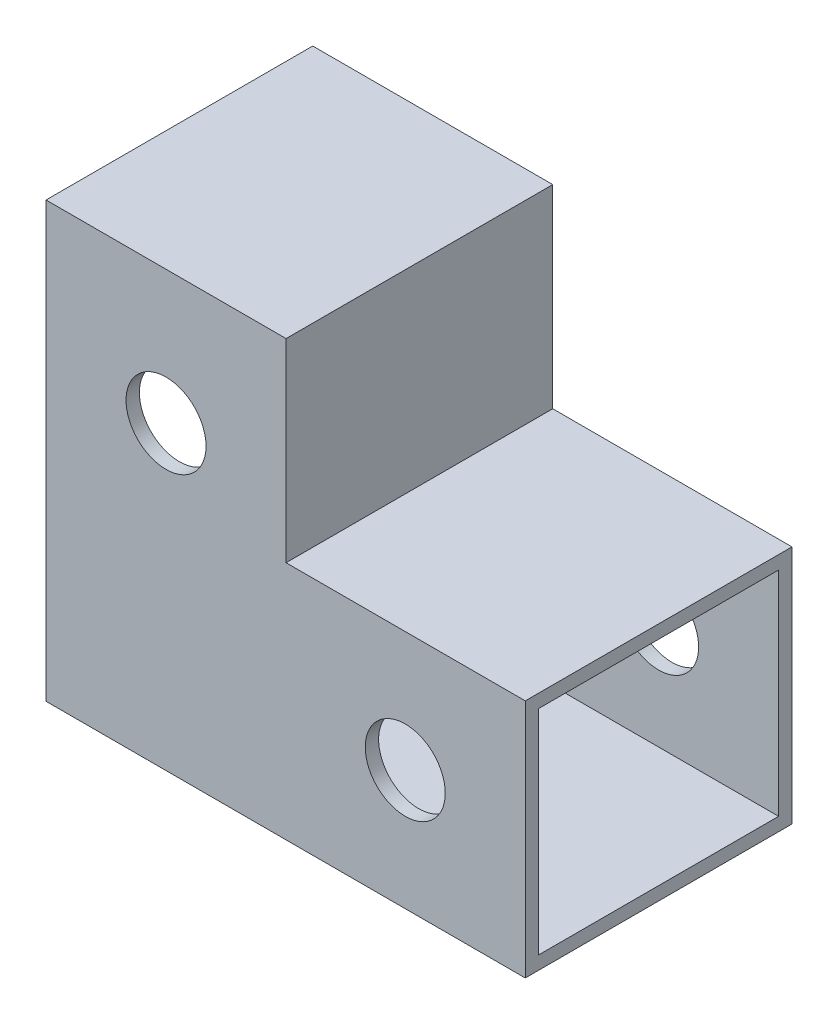
ISO-10303-21;
HEADER;
FILE_DESCRIPTION(('STEP AP214'),'2;1');
FILE_NAME('part.step','',(''),(''),'','','');
FILE_SCHEMA(('AUTOMOTIVE_DESIGN { 1 0 10303 214 1 1 1 1 }'));
ENDSEC;
DATA;
#1=APPLICATION_CONTEXT('core data for automotive mechanical design processes');
#2=APPLICATION_PROTOCOL_DEFINITION('international standard','automotive_design',2000,#1);
#3=PRODUCT_CONTEXT('',#1,'mechanical');
#4=PRODUCT('Part','Part','',(#3));
#5=PRODUCT_RELATED_PRODUCT_CATEGORY('part','',(#4));
#6=PRODUCT_DEFINITION_FORMATION('','',#4);
#7=PRODUCT_DEFINITION_CONTEXT('part definition',#1,'design');
#8=PRODUCT_DEFINITION('design','',#6,#7);
#9=PRODUCT_DEFINITION_SHAPE('','',#8);
#10=(LENGTH_UNIT() NAMED_UNIT(*) SI_UNIT(.MILLI.,.METRE.));
#11=(NAMED_UNIT(*) PLANE_ANGLE_UNIT() SI_UNIT($,.RADIAN.));
#12=(NAMED_UNIT(*) SI_UNIT($,.STERADIAN.) SOLID_ANGLE_UNIT());
#13=UNCERTAINTY_MEASURE_WITH_UNIT(LENGTH_MEASURE(1.E-05),#10,'distance_accuracy_value','');
#14=(GEOMETRIC_REPRESENTATION_CONTEXT(3) GLOBAL_UNCERTAINTY_ASSIGNED_CONTEXT((#13)) GLOBAL_UNIT_ASSIGNED_CONTEXT((#10,
#11,#12)) REPRESENTATION_CONTEXT('',''));
#15=CARTESIAN_POINT('',(0.,0.,0.));
#16=DIRECTION('',(0.,0.,1.));
#17=DIRECTION('',(1.,0.,0.));
#18=AXIS2_PLACEMENT_3D('',#15,#16,#17);
#19=CARTESIAN_POINT('',(-17.94,13.56,20.));
#20=DIRECTION('',(0.,0.,-1.));
#21=DIRECTION('',(-1.,0.,0.));
#22=AXIS2_PLACEMENT_3D('',#19,#20,#21);
#23=CYLINDRICAL_SURFACE('',#22,3.);
#24=CARTESIAN_POINT('',(-17.94,13.56,1.));
#25=DIRECTION('',(0.,0.,-1.));
#26=DIRECTION('',(-1.,0.,0.));
#27=AXIS2_PLACEMENT_3D('',#24,#25,#26);
#28=CIRCLE('',#27,3.);
#29=CARTESIAN_POINT('',(-20.94,13.56,1.));
#30=VERTEX_POINT('',#29);
#31=EDGE_CURVE('E195',#30,#30,#28,.T.);
#32=ORIENTED_EDGE('',*,*,#31,.F.);
#33=EDGE_LOOP('',(#32));
#34=FACE_BOUND('',#33,.T.);
#35=CARTESIAN_POINT('',(-17.94,13.56,0.));
#36=DIRECTION('',(0.,0.,1.));
#37=DIRECTION('',(1.,0.,0.));
#38=AXIS2_PLACEMENT_3D('',#35,#36,#37);
#39=CIRCLE('',#38,3.);
#40=CARTESIAN_POINT('',(-14.94,13.56,0.));
#41=VERTEX_POINT('',#40);
#42=EDGE_CURVE('E267',#41,#41,#39,.T.);
#43=ORIENTED_EDGE('',*,*,#42,.F.);
#44=EDGE_LOOP('',(#43));
#45=FACE_BOUND('',#44,.T.);
#46=ADVANCED_FACE('F63',(#34,#45),#23,.F.);
#47=CARTESIAN_POINT('',(-26.94,8.,0.));
#48=DIRECTION('',(0.,1.,0.));
#49=DIRECTION('',(-1.,0.,0.));
#50=AXIS2_PLACEMENT_3D('',#47,#48,#49);
#51=PLANE('',#50);
#52=DIRECTION('',(0.,0.,1.));
#53=VECTOR('',#52,1.);
#54=CARTESIAN_POINT('',(-9.93999999999999,8.,0.));
#55=LINE('',#54,#53);
#56=CARTESIAN_POINT('',(-9.93999999999999,8.,1.));
#57=VERTEX_POINT('',#56);
#58=CARTESIAN_POINT('',(-9.94,8.,19.));
#59=VERTEX_POINT('',#58);
#60=EDGE_CURVE('E160',#57,#59,#55,.T.);
#61=ORIENTED_EDGE('',*,*,#60,.F.);
#62=DIRECTION('',(1.,0.,0.));
#63=VECTOR('',#62,1.);
#64=CARTESIAN_POINT('',(-26.94,8.,1.));
#65=LINE('',#64,#63);
#66=CARTESIAN_POINT('',(9.,8.,1.));
#67=VERTEX_POINT('',#66);
#68=EDGE_CURVE('E229',#57,#67,#65,.T.);
#69=ORIENTED_EDGE('',*,*,#68,.T.);
#70=DIRECTION('',(0.,0.,1.));
#71=VECTOR('',#70,1.);
#72=CARTESIAN_POINT('',(9.,8.,0.));
#73=LINE('',#72,#71);
#74=CARTESIAN_POINT('',(9.,8.,19.));
#75=VERTEX_POINT('',#74);
#76=EDGE_CURVE('E215',#67,#75,#73,.T.);
#77=ORIENTED_EDGE('',*,*,#76,.T.);
#78=DIRECTION('',(1.,0.,0.));
#79=VECTOR('',#78,1.);
#80=CARTESIAN_POINT('',(-26.94,8.,19.));
#81=LINE('',#80,#79);
#82=EDGE_CURVE('E226',#59,#75,#81,.T.);
#83=ORIENTED_EDGE('',*,*,#82,.F.);
#84=EDGE_LOOP('',(#61,#69,#77,#83));
#85=FACE_BOUND('',#84,.T.);
#86=ADVANCED_FACE('F319',(#85),#51,.F.);
#87=CARTESIAN_POINT('',(0.,0.,20.));
#88=DIRECTION('',(0.,0.,-1.));
#89=DIRECTION('',(-1.,0.,0.));
#90=AXIS2_PLACEMENT_3D('',#87,#88,#89);
#91=CYLINDRICAL_SURFACE('',#90,3.);
#92=CARTESIAN_POINT('',(0.,0.,19.));
#93=DIRECTION('',(0.,0.,1.));
#94=DIRECTION('',(1.,0.,0.));
#95=AXIS2_PLACEMENT_3D('',#92,#93,#94);
#96=CIRCLE('',#95,3.);
#97=CARTESIAN_POINT('',(3.,0.,19.));
#98=VERTEX_POINT('',#97);
#99=EDGE_CURVE('E67',#98,#98,#96,.T.);
#100=ORIENTED_EDGE('',*,*,#99,.F.);
#101=EDGE_LOOP('',(#100));
#102=FACE_BOUND('',#101,.T.);
#103=CARTESIAN_POINT('',(0.,0.,20.));
#104=DIRECTION('',(0.,0.,1.));
#105=DIRECTION('',(1.,0.,0.));
#106=AXIS2_PLACEMENT_3D('',#103,#104,#105);
#107=CIRCLE('',#106,3.);
#108=CARTESIAN_POINT('',(3.,0.,20.));
#109=VERTEX_POINT('',#108);
#110=EDGE_CURVE('E234',#109,#109,#107,.T.);
#111=ORIENTED_EDGE('',*,*,#110,.T.);
#112=EDGE_LOOP('',(#111));
#113=FACE_BOUND('',#112,.T.);
#114=ADVANCED_FACE('F315',(#102,#113),#91,.F.);
#115=CARTESIAN_POINT('',(-8.94,0.,20.));
#116=DIRECTION('',(-1.,0.,0.));
#117=DIRECTION('',(0.,-1.,0.));
#118=AXIS2_PLACEMENT_3D('',#115,#116,#117);
#119=PLANE('',#118);
#120=DIRECTION('',(0.,1.,0.));
#121=VECTOR('',#120,1.);
#122=CARTESIAN_POINT('',(-8.94,0.,0.));
#123=LINE('',#122,#121);
#124=CARTESIAN_POINT('',(-8.94,9.,0.));
#125=VERTEX_POINT('',#124);
#126=CARTESIAN_POINT('',(-8.94,23.56,0.));
#127=VERTEX_POINT('',#126);
#128=EDGE_CURVE('E271',#125,#127,#123,.T.);
#129=ORIENTED_EDGE('',*,*,#128,.T.);
#130=DIRECTION('',(0.,0.,-1.));
#131=VECTOR('',#130,1.);
#132=CARTESIAN_POINT('',(-8.94,23.56,20.));
#133=LINE('',#132,#131);
#134=CARTESIAN_POINT('',(-8.94,23.56,20.));
#135=VERTEX_POINT('',#134);
#136=EDGE_CURVE('E12',#135,#127,#133,.T.);
#137=ORIENTED_EDGE('',*,*,#136,.F.);
#138=DIRECTION('',(0.,1.,0.));
#139=VECTOR('',#138,1.);
#140=CARTESIAN_POINT('',(-8.94,0.,20.));
#141=LINE('',#140,#139);
#142=CARTESIAN_POINT('',(-8.94,9.,20.));
#143=VERTEX_POINT('',#142);
#144=EDGE_CURVE('E243',#143,#135,#141,.T.);
#145=ORIENTED_EDGE('',*,*,#144,.F.);
#146=DIRECTION('',(0.,0.,-1.));
#147=VECTOR('',#146,1.);
#148=CARTESIAN_POINT('',(-8.94,9.,20.));
#149=LINE('',#148,#147);
#150=EDGE_CURVE('E262',#143,#125,#149,.T.);
#151=ORIENTED_EDGE('',*,*,#150,.T.);
#152=EDGE_LOOP('',(#129,#137,#145,#151));
#153=FACE_BOUND('',#152,.T.);
#154=ADVANCED_FACE('F318',(#153),#119,.F.);
#155=CARTESIAN_POINT('',(0.,23.56,20.));
#156=DIRECTION('',(0.,-1.,0.));
#157=DIRECTION('',(1.,0.,0.));
#158=AXIS2_PLACEMENT_3D('',#155,#156,#157);
#159=PLANE('',#158);
#160=DIRECTION('',(-1.,0.,0.));
#161=VECTOR('',#160,1.);
#162=CARTESIAN_POINT('',(0.,23.56,0.));
#163=LINE('',#162,#161);
#164=CARTESIAN_POINT('',(-26.94,23.56,0.));
#165=VERTEX_POINT('',#164);
#166=EDGE_CURVE('E275',#127,#165,#163,.T.);
#167=ORIENTED_EDGE('',*,*,#166,.T.);
#168=DIRECTION('',(0.,0.,-1.));
#169=VECTOR('',#168,1.);
#170=CARTESIAN_POINT('',(-26.94,23.56,20.));
#171=LINE('',#170,#169);
#172=CARTESIAN_POINT('',(-26.94,23.56,20.));
#173=VERTEX_POINT('',#172);
#174=EDGE_CURVE('E73',#173,#165,#171,.T.);
#175=ORIENTED_EDGE('',*,*,#174,.F.);
#176=DIRECTION('',(-1.,0.,0.));
#177=VECTOR('',#176,1.);
#178=CARTESIAN_POINT('',(0.,23.56,20.));
#179=LINE('',#178,#177);
#180=EDGE_CURVE('E247',#135,#173,#179,.T.);
#181=ORIENTED_EDGE('',*,*,#180,.F.);
#182=ORIENTED_EDGE('',*,*,#136,.T.);
#183=EDGE_LOOP('',(#167,#175,#181,#182));
#184=FACE_BOUND('',#183,.T.);
#185=ADVANCED_FACE('F338',(#184),#159,.F.);
#186=CARTESIAN_POINT('',(-26.94,0.,20.));
#187=DIRECTION('',(1.,0.,0.));
#188=DIRECTION('',(0.,1.,0.));
#189=AXIS2_PLACEMENT_3D('',#186,#187,#188);
#190=PLANE('',#189);
#191=DIRECTION('',(0.,1.,0.));
#192=VECTOR('',#191,1.);
#193=CARTESIAN_POINT('',(-26.94,0.,1.));
#194=LINE('',#193,#192);
#195=CARTESIAN_POINT('',(-26.94,-8.,1.));
#196=VERTEX_POINT('',#195);
#197=CARTESIAN_POINT('',(-26.94,22.56,1.));
#198=VERTEX_POINT('',#197);
#199=EDGE_CURVE('E204',#196,#198,#194,.T.);
#200=ORIENTED_EDGE('',*,*,#199,.T.);
#201=DIRECTION('',(0.,0.,-1.));
#202=VECTOR('',#201,1.);
#203=CARTESIAN_POINT('',(-26.94,22.56,0.));
#204=LINE('',#203,#202);
#205=CARTESIAN_POINT('',(-26.94,22.56,19.));
#206=VERTEX_POINT('',#205);
#207=EDGE_CURVE('E164',#206,#198,#204,.T.);
#208=ORIENTED_EDGE('',*,*,#207,.F.);
#209=DIRECTION('',(0.,-1.,0.));
#210=VECTOR('',#209,1.);
#211=CARTESIAN_POINT('',(-26.94,0.,19.));
#212=LINE('',#211,#210);
#213=CARTESIAN_POINT('',(-26.94,-8.,19.));
#214=VERTEX_POINT('',#213);
#215=EDGE_CURVE('E171',#206,#214,#212,.T.);
#216=ORIENTED_EDGE('',*,*,#215,.T.);
#217=DIRECTION('',(0.,0.,-1.));
#218=VECTOR('',#217,1.);
#219=CARTESIAN_POINT('',(-26.94,-8.,0.));
#220=LINE('',#219,#218);
#221=EDGE_CURVE('E200',#214,#196,#220,.T.);
#222=ORIENTED_EDGE('',*,*,#221,.T.);
#223=EDGE_LOOP('',(#200,#208,#216,#222));
#224=FACE_BOUND('',#223,.T.);
#225=DIRECTION('',(0.,-1.,0.));
#226=VECTOR('',#225,1.);
#227=CARTESIAN_POINT('',(-26.94,0.,0.));
#228=LINE('',#227,#226);
#229=CARTESIAN_POINT('',(-26.94,-9.,0.));
#230=VERTEX_POINT('',#229);
#231=EDGE_CURVE('E278',#165,#230,#228,.T.);
#232=ORIENTED_EDGE('',*,*,#231,.T.);
#233=DIRECTION('',(0.,0.,-1.));
#234=VECTOR('',#233,1.);
#235=CARTESIAN_POINT('',(-26.94,-9.,20.));
#236=LINE('',#235,#234);
#237=CARTESIAN_POINT('',(-26.94,-9.,20.));
#238=VERTEX_POINT('',#237);
#239=EDGE_CURVE('E300',#238,#230,#236,.T.);
#240=ORIENTED_EDGE('',*,*,#239,.F.);
#241=DIRECTION('',(0.,-1.,0.));
#242=VECTOR('',#241,1.);
#243=CARTESIAN_POINT('',(-26.94,0.,20.));
#244=LINE('',#243,#242);
#245=EDGE_CURVE('E250',#173,#238,#244,.T.);
#246=ORIENTED_EDGE('',*,*,#245,.F.);
#247=ORIENTED_EDGE('',*,*,#174,.T.);
#248=EDGE_LOOP('',(#232,#240,#246,#247));
#249=FACE_BOUND('',#248,.T.);
#250=ADVANCED_FACE('F343',(#224,#249),#190,.F.);
#251=CARTESIAN_POINT('',(0.,-9.,20.));
#252=DIRECTION('',(0.,1.,0.));
#253=DIRECTION('',(-1.,0.,0.));
#254=AXIS2_PLACEMENT_3D('',#251,#252,#253);
#255=PLANE('',#254);
#256=DIRECTION('',(1.,0.,0.));
#257=VECTOR('',#256,1.);
#258=CARTESIAN_POINT('',(0.,-9.,0.));
#259=LINE('',#258,#257);
#260=CARTESIAN_POINT('',(9.,-9.,0.));
#261=VERTEX_POINT('',#260);
#262=EDGE_CURVE('E281',#230,#261,#259,.T.);
#263=ORIENTED_EDGE('',*,*,#262,.T.);
#264=DIRECTION('',(0.,0.,-1.));
#265=VECTOR('',#264,1.);
#266=CARTESIAN_POINT('',(9.,-9.,20.));
#267=LINE('',#266,#265);
#268=CARTESIAN_POINT('',(9.,-9.,20.));
#269=VERTEX_POINT('',#268);
#270=EDGE_CURVE('E296',#269,#261,#267,.T.);
#271=ORIENTED_EDGE('',*,*,#270,.F.);
#272=DIRECTION('',(1.,0.,0.));
#273=VECTOR('',#272,1.);
#274=CARTESIAN_POINT('',(0.,-9.,20.));
#275=LINE('',#274,#273);
#276=EDGE_CURVE('E253',#238,#269,#275,.T.);
#277=ORIENTED_EDGE('',*,*,#276,.F.);
#278=ORIENTED_EDGE('',*,*,#239,.T.);
#279=EDGE_LOOP('',(#263,#271,#277,#278));
#280=FACE_BOUND('',#279,.T.);
#281=ADVANCED_FACE('F349',(#280),#255,.F.);
#282=CARTESIAN_POINT('',(9.,0.,20.));
#283=DIRECTION('',(-1.,0.,0.));
#284=DIRECTION('',(0.,-1.,0.));
#285=AXIS2_PLACEMENT_3D('',#282,#283,#284);
#286=PLANE('',#285);
#287=DIRECTION('',(0.,1.,0.));
#288=VECTOR('',#287,1.);
#289=CARTESIAN_POINT('',(9.,0.,1.));
#290=LINE('',#289,#288);
#291=CARTESIAN_POINT('',(9.,-8.,1.));
#292=VERTEX_POINT('',#291);
#293=EDGE_CURVE('E212',#292,#67,#290,.T.);
#294=ORIENTED_EDGE('',*,*,#293,.F.);
#295=DIRECTION('',(0.,0.,-1.));
#296=VECTOR('',#295,1.);
#297=CARTESIAN_POINT('',(9.,-8.,0.));
#298=LINE('',#297,#296);
#299=CARTESIAN_POINT('',(9.,-8.,19.));
#300=VERTEX_POINT('',#299);
#301=EDGE_CURVE('E199',#300,#292,#298,.T.);
#302=ORIENTED_EDGE('',*,*,#301,.F.);
#303=DIRECTION('',(0.,-1.,0.));
#304=VECTOR('',#303,1.);
#305=CARTESIAN_POINT('',(9.,0.,19.));
#306=LINE('',#305,#304);
#307=EDGE_CURVE('E205',#75,#300,#306,.T.);
#308=ORIENTED_EDGE('',*,*,#307,.F.);
#309=ORIENTED_EDGE('',*,*,#76,.F.);
#310=EDGE_LOOP('',(#294,#302,#308,#309));
#311=FACE_BOUND('',#310,.T.);
#312=DIRECTION('',(0.,1.,0.));
#313=VECTOR('',#312,1.);
#314=CARTESIAN_POINT('',(9.,0.,0.));
#315=LINE('',#314,#313);
#316=CARTESIAN_POINT('',(9.,9.,0.));
#317=VERTEX_POINT('',#316);
#318=EDGE_CURVE('E284',#261,#317,#315,.T.);
#319=ORIENTED_EDGE('',*,*,#318,.T.);
#320=DIRECTION('',(0.,0.,-1.));
#321=VECTOR('',#320,1.);
#322=CARTESIAN_POINT('',(9.,9.,20.));
#323=LINE('',#322,#321);
#324=CARTESIAN_POINT('',(9.,9.,20.));
#325=VERTEX_POINT('',#324);
#326=EDGE_CURVE('E292',#325,#317,#323,.T.);
#327=ORIENTED_EDGE('',*,*,#326,.F.);
#328=DIRECTION('',(0.,1.,0.));
#329=VECTOR('',#328,1.);
#330=CARTESIAN_POINT('',(9.,0.,20.));
#331=LINE('',#330,#329);
#332=EDGE_CURVE('E256',#269,#325,#331,.T.);
#333=ORIENTED_EDGE('',*,*,#332,.F.);
#334=ORIENTED_EDGE('',*,*,#270,.T.);
#335=EDGE_LOOP('',(#319,#327,#333,#334));
#336=FACE_BOUND('',#335,.T.);
#337=ADVANCED_FACE('F353',(#311,#336),#286,.F.);
#338=CARTESIAN_POINT('',(-17.94,13.56,19.));
#339=DIRECTION('',(0.,0.,1.));
#340=DIRECTION('',(1.,0.,0.));
#341=AXIS2_PLACEMENT_3D('',#338,#339,#340);
#342=CIRCLE('',#341,3.);
#343=CARTESIAN_POINT('',(-14.94,13.56,19.));
#344=VERTEX_POINT('',#343);
#345=EDGE_CURVE('E191',#344,#344,#342,.T.);
#346=ORIENTED_EDGE('',*,*,#345,.F.);
#347=EDGE_LOOP('',(#346));
#348=FACE_BOUND('',#347,.T.);
#349=CARTESIAN_POINT('',(-17.94,13.56,20.));
#350=DIRECTION('',(0.,0.,1.));
#351=DIRECTION('',(1.,0.,0.));
#352=AXIS2_PLACEMENT_3D('',#349,#350,#351);
#353=CIRCLE('',#352,3.);
#354=CARTESIAN_POINT('',(-14.94,13.56,20.));
#355=VERTEX_POINT('',#354);
#356=EDGE_CURVE('E238',#355,#355,#353,.T.);
#357=ORIENTED_EDGE('',*,*,#356,.T.);
#358=EDGE_LOOP('',(#357));
#359=FACE_BOUND('',#358,.T.);
#360=ADVANCED_FACE('F370',(#348,#359),#23,.F.);
#361=CARTESIAN_POINT('',(0.,0.,1.));
#362=DIRECTION('',(0.,0.,-1.));
#363=DIRECTION('',(-1.,0.,0.));
#364=AXIS2_PLACEMENT_3D('',#361,#362,#363);
#365=CIRCLE('',#364,3.);
#366=CARTESIAN_POINT('',(-3.,0.,1.));
#367=VERTEX_POINT('',#366);
#368=EDGE_CURVE('E225',#367,#367,#365,.T.);
#369=ORIENTED_EDGE('',*,*,#368,.F.);
#370=EDGE_LOOP('',(#369));
#371=FACE_BOUND('',#370,.T.);
#372=CARTESIAN_POINT('',(0.,0.,0.));
#373=DIRECTION('',(0.,0.,1.));
#374=DIRECTION('',(1.,0.,0.));
#375=AXIS2_PLACEMENT_3D('',#372,#373,#374);
#376=CIRCLE('',#375,3.);
#377=CARTESIAN_POINT('',(3.,0.,0.));
#378=VERTEX_POINT('',#377);
#379=EDGE_CURVE('E263',#378,#378,#376,.T.);
#380=ORIENTED_EDGE('',*,*,#379,.F.);
#381=EDGE_LOOP('',(#380));
#382=FACE_BOUND('',#381,.T.);
#383=ADVANCED_FACE('F65',(#371,#382),#91,.F.);
#384=CARTESIAN_POINT('',(0.,9.,20.));
#385=DIRECTION('',(0.,-1.,0.));
#386=DIRECTION('',(1.,0.,0.));
#387=AXIS2_PLACEMENT_3D('',#384,#385,#386);
#388=PLANE('',#387);
#389=DIRECTION('',(-1.,0.,0.));
#390=VECTOR('',#389,1.);
#391=CARTESIAN_POINT('',(0.,9.,0.));
#392=LINE('',#391,#390);
#393=EDGE_CURVE('E239',#317,#125,#392,.T.);
#394=ORIENTED_EDGE('',*,*,#393,.T.);
#395=ORIENTED_EDGE('',*,*,#150,.F.);
#396=DIRECTION('',(-1.,0.,0.));
#397=VECTOR('',#396,1.);
#398=CARTESIAN_POINT('',(0.,9.,20.));
#399=LINE('',#398,#397);
#400=EDGE_CURVE('E259',#325,#143,#399,.T.);
#401=ORIENTED_EDGE('',*,*,#400,.F.);
#402=ORIENTED_EDGE('',*,*,#326,.T.);
#403=EDGE_LOOP('',(#394,#395,#401,#402));
#404=FACE_BOUND('',#403,.T.);
#405=ADVANCED_FACE('F326',(#404),#388,.F.);
#406=CARTESIAN_POINT('',(0.,0.,20.));
#407=DIRECTION('',(0.,0.,1.));
#408=DIRECTION('',(1.,0.,0.));
#409=AXIS2_PLACEMENT_3D('',#406,#407,#408);
#410=PLANE('',#409);
#411=ORIENTED_EDGE('',*,*,#110,.F.);
#412=EDGE_LOOP('',(#411));
#413=FACE_BOUND('',#412,.T.);
#414=ORIENTED_EDGE('',*,*,#356,.F.);
#415=EDGE_LOOP('',(#414));
#416=FACE_BOUND('',#415,.T.);
#417=ORIENTED_EDGE('',*,*,#144,.T.);
#418=ORIENTED_EDGE('',*,*,#180,.T.);
#419=ORIENTED_EDGE('',*,*,#245,.T.);
#420=ORIENTED_EDGE('',*,*,#276,.T.);
#421=ORIENTED_EDGE('',*,*,#332,.T.);
#422=ORIENTED_EDGE('',*,*,#400,.T.);
#423=EDGE_LOOP('',(#417,#418,#419,#420,#421,#422));
#424=FACE_BOUND('',#423,.T.);
#425=ADVANCED_FACE('F322',(#413,#416,#424),#410,.T.);
#426=CARTESIAN_POINT('',(0.,0.,0.));
#427=DIRECTION('',(0.,0.,1.));
#428=DIRECTION('',(1.,0.,0.));
#429=AXIS2_PLACEMENT_3D('',#426,#427,#428);
#430=PLANE('',#429);
#431=ORIENTED_EDGE('',*,*,#379,.T.);
#432=EDGE_LOOP('',(#431));
#433=FACE_BOUND('',#432,.T.);
#434=ORIENTED_EDGE('',*,*,#42,.T.);
#435=EDGE_LOOP('',(#434));
#436=FACE_BOUND('',#435,.T.);
#437=ORIENTED_EDGE('',*,*,#128,.F.);
#438=ORIENTED_EDGE('',*,*,#393,.F.);
#439=ORIENTED_EDGE('',*,*,#318,.F.);
#440=ORIENTED_EDGE('',*,*,#262,.F.);
#441=ORIENTED_EDGE('',*,*,#231,.F.);
#442=ORIENTED_EDGE('',*,*,#166,.F.);
#443=EDGE_LOOP('',(#437,#438,#439,#440,#441,#442));
#444=FACE_BOUND('',#443,.T.);
#445=ADVANCED_FACE('F325',(#433,#436,#444),#430,.F.);
#446=CARTESIAN_POINT('',(-26.94,-8.,0.));
#447=DIRECTION('',(0.,-1.,0.));
#448=DIRECTION('',(1.,0.,0.));
#449=AXIS2_PLACEMENT_3D('',#446,#447,#448);
#450=PLANE('',#449);
#451=DIRECTION('',(1.,0.,0.));
#452=VECTOR('',#451,1.);
#453=CARTESIAN_POINT('',(-26.94,-8.,19.));
#454=LINE('',#453,#452);
#455=EDGE_CURVE('E222',#214,#300,#454,.T.);
#456=ORIENTED_EDGE('',*,*,#455,.T.);
#457=ORIENTED_EDGE('',*,*,#301,.T.);
#458=DIRECTION('',(1.,0.,0.));
#459=VECTOR('',#458,1.);
#460=CARTESIAN_POINT('',(-26.94,-8.,1.));
#461=LINE('',#460,#459);
#462=EDGE_CURVE('E89',#196,#292,#461,.T.);
#463=ORIENTED_EDGE('',*,*,#462,.F.);
#464=ORIENTED_EDGE('',*,*,#221,.F.);
#465=EDGE_LOOP('',(#456,#457,#463,#464));
#466=FACE_BOUND('',#465,.T.);
#467=ADVANCED_FACE('F358',(#466),#450,.F.);
#468=CARTESIAN_POINT('',(-26.94,0.,19.));
#469=DIRECTION('',(0.,0.,1.));
#470=DIRECTION('',(1.,0.,0.));
#471=AXIS2_PLACEMENT_3D('',#468,#469,#470);
#472=PLANE('',#471);
#473=ORIENTED_EDGE('',*,*,#215,.F.);
#474=DIRECTION('',(-1.,0.,0.));
#475=VECTOR('',#474,1.);
#476=CARTESIAN_POINT('',(-9.94,22.56,19.));
#477=LINE('',#476,#475);
#478=CARTESIAN_POINT('',(-9.94,22.56,19.));
#479=VERTEX_POINT('',#478);
#480=EDGE_CURVE('E167',#479,#206,#477,.T.);
#481=ORIENTED_EDGE('',*,*,#480,.F.);
#482=DIRECTION('',(0.,1.,0.));
#483=VECTOR('',#482,1.);
#484=CARTESIAN_POINT('',(-9.93999999999999,0.,19.));
#485=LINE('',#484,#483);
#486=EDGE_CURVE('E155',#59,#479,#485,.T.);
#487=ORIENTED_EDGE('',*,*,#486,.F.);
#488=ORIENTED_EDGE('',*,*,#82,.T.);
#489=ORIENTED_EDGE('',*,*,#307,.T.);
#490=ORIENTED_EDGE('',*,*,#455,.F.);
#491=EDGE_LOOP('',(#473,#481,#487,#488,#489,#490));
#492=FACE_BOUND('',#491,.T.);
#493=ORIENTED_EDGE('',*,*,#345,.T.);
#494=EDGE_LOOP('',(#493));
#495=FACE_BOUND('',#494,.T.);
#496=ORIENTED_EDGE('',*,*,#99,.T.);
#497=EDGE_LOOP('',(#496));
#498=FACE_BOUND('',#497,.T.);
#499=ADVANCED_FACE('F168',(#492,#495,#498),#472,.F.);
#500=CARTESIAN_POINT('',(-26.94,0.,1.));
#501=DIRECTION('',(0.,0.,-1.));
#502=DIRECTION('',(-1.,0.,0.));
#503=AXIS2_PLACEMENT_3D('',#500,#501,#502);
#504=PLANE('',#503);
#505=ORIENTED_EDGE('',*,*,#462,.T.);
#506=ORIENTED_EDGE('',*,*,#293,.T.);
#507=ORIENTED_EDGE('',*,*,#68,.F.);
#508=DIRECTION('',(0.,-1.,0.));
#509=VECTOR('',#508,1.);
#510=CARTESIAN_POINT('',(-9.93999999999999,0.,1.));
#511=LINE('',#510,#509);
#512=CARTESIAN_POINT('',(-9.94,22.56,1.));
#513=VERTEX_POINT('',#512);
#514=EDGE_CURVE('E81',#513,#57,#511,.T.);
#515=ORIENTED_EDGE('',*,*,#514,.F.);
#516=DIRECTION('',(-1.,0.,0.));
#517=VECTOR('',#516,1.);
#518=CARTESIAN_POINT('',(-9.94,22.56,1.));
#519=LINE('',#518,#517);
#520=EDGE_CURVE('E176',#513,#198,#519,.T.);
#521=ORIENTED_EDGE('',*,*,#520,.T.);
#522=ORIENTED_EDGE('',*,*,#199,.F.);
#523=EDGE_LOOP('',(#505,#506,#507,#515,#521,#522));
#524=FACE_BOUND('',#523,.T.);
#525=ORIENTED_EDGE('',*,*,#368,.T.);
#526=EDGE_LOOP('',(#525));
#527=FACE_BOUND('',#526,.T.);
#528=ORIENTED_EDGE('',*,*,#31,.T.);
#529=EDGE_LOOP('',(#528));
#530=FACE_BOUND('',#529,.T.);
#531=ADVANCED_FACE('F391',(#524,#527,#530),#504,.F.);
#532=CARTESIAN_POINT('',(-9.93999999999999,0.,0.));
#533=DIRECTION('',(-1.,0.,0.));
#534=DIRECTION('',(0.,-1.,0.));
#535=AXIS2_PLACEMENT_3D('',#532,#533,#534);
#536=PLANE('',#535);
#537=ORIENTED_EDGE('',*,*,#60,.T.);
#538=ORIENTED_EDGE('',*,*,#486,.T.);
#539=DIRECTION('',(0.,0.,-1.));
#540=VECTOR('',#539,1.);
#541=CARTESIAN_POINT('',(-9.94,22.56,0.));
#542=LINE('',#541,#540);
#543=EDGE_CURVE('E159',#479,#513,#542,.T.);
#544=ORIENTED_EDGE('',*,*,#543,.T.);
#545=ORIENTED_EDGE('',*,*,#514,.T.);
#546=EDGE_LOOP('',(#537,#538,#544,#545));
#547=FACE_BOUND('',#546,.T.);
#548=ADVANCED_FACE('F157',(#547),#536,.T.);
#549=CARTESIAN_POINT('',(-9.94,22.56,0.));
#550=DIRECTION('',(0.,1.,0.));
#551=DIRECTION('',(-1.,0.,0.));
#552=AXIS2_PLACEMENT_3D('',#549,#550,#551);
#553=PLANE('',#552);
#554=ORIENTED_EDGE('',*,*,#207,.T.);
#555=ORIENTED_EDGE('',*,*,#520,.F.);
#556=ORIENTED_EDGE('',*,*,#543,.F.);
#557=ORIENTED_EDGE('',*,*,#480,.T.);
#558=EDGE_LOOP('',(#554,#555,#556,#557));
#559=FACE_BOUND('',#558,.T.);
#560=ADVANCED_FACE('F178',(#559),#553,.F.);
#561=CLOSED_SHELL('',(#46,#86,#114,#154,#185,#250,#281,#337,#360,#383,#405,#425,#445,#467,#499,
#531,#548,#560));
#562=MANIFOLD_SOLID_BREP('B2',#561);
#563=ADVANCED_BREP_SHAPE_REPRESENTATION('',(#18,#562),#14);
#564=SHAPE_DEFINITION_REPRESENTATION(#9,#563);
ENDSEC;
END-ISO-10303-21;
